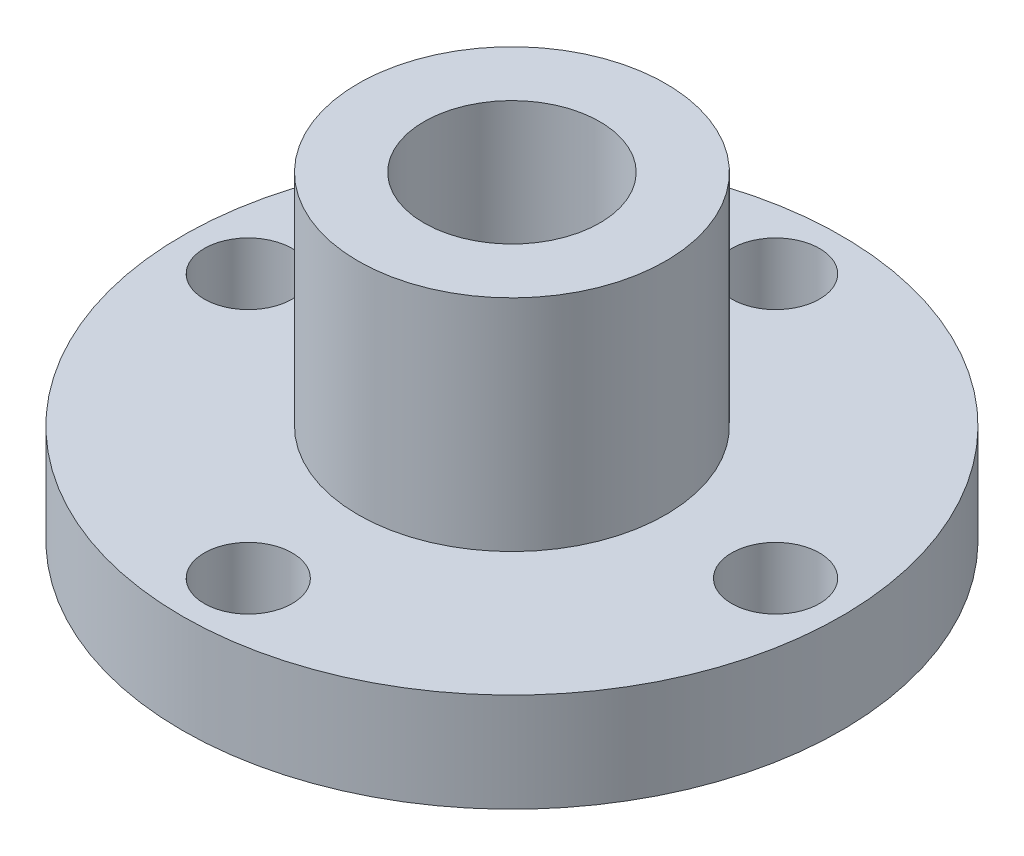
ISO-10303-21;
HEADER;
FILE_DESCRIPTION(('STEP AP214'),'2;1');
FILE_NAME('part.step','',(''),(''),'','','');
FILE_SCHEMA(('AUTOMOTIVE_DESIGN { 1 0 10303 214 1 1 1 1 }'));
ENDSEC;
DATA;
#1=APPLICATION_CONTEXT('core data for automotive mechanical design processes');
#2=APPLICATION_PROTOCOL_DEFINITION('international standard','automotive_design',2000,#1);
#3=PRODUCT_CONTEXT('',#1,'mechanical');
#4=PRODUCT('Part','Part','',(#3));
#5=PRODUCT_RELATED_PRODUCT_CATEGORY('part','',(#4));
#6=PRODUCT_DEFINITION_FORMATION('','',#4);
#7=PRODUCT_DEFINITION_CONTEXT('part definition',#1,'design');
#8=PRODUCT_DEFINITION('design','',#6,#7);
#9=PRODUCT_DEFINITION_SHAPE('','',#8);
#10=(LENGTH_UNIT() NAMED_UNIT(*) SI_UNIT(.MILLI.,.METRE.));
#11=(NAMED_UNIT(*) PLANE_ANGLE_UNIT() SI_UNIT($,.RADIAN.));
#12=(NAMED_UNIT(*) SI_UNIT($,.STERADIAN.) SOLID_ANGLE_UNIT());
#13=UNCERTAINTY_MEASURE_WITH_UNIT(LENGTH_MEASURE(1.E-05),#10,'distance_accuracy_value','');
#14=(GEOMETRIC_REPRESENTATION_CONTEXT(3) GLOBAL_UNCERTAINTY_ASSIGNED_CONTEXT((#13)) GLOBAL_UNIT_ASSIGNED_CONTEXT((#10,
#11,#12)) REPRESENTATION_CONTEXT('',''));
#15=CARTESIAN_POINT('',(0.,0.,0.));
#16=DIRECTION('',(0.,0.,1.));
#17=DIRECTION('',(1.,0.,0.));
#18=AXIS2_PLACEMENT_3D('',#15,#16,#17);
#19=CARTESIAN_POINT('',(0.,4.49999999999999,0.));
#20=DIRECTION('',(0.,-1.,0.));
#21=DIRECTION('',(0.,0.,-1.));
#22=AXIS2_PLACEMENT_3D('',#19,#20,#21);
#23=CYLINDRICAL_SURFACE('',#22,15.);
#24=CARTESIAN_POINT('',(0.,4.49999999999999,0.));
#25=DIRECTION('',(0.,1.,0.));
#26=DIRECTION('',(0.,0.,1.));
#27=AXIS2_PLACEMENT_3D('',#24,#25,#26);
#28=CIRCLE('',#27,15.);
#29=CARTESIAN_POINT('',(0.,4.49999999999999,15.));
#30=VERTEX_POINT('',#29);
#31=EDGE_CURVE('E41',#30,#30,#28,.T.);
#32=ORIENTED_EDGE('',*,*,#31,.F.);
#33=EDGE_LOOP('',(#32));
#34=FACE_BOUND('',#33,.T.);
#35=CARTESIAN_POINT('',(0.,0.,0.));
#36=DIRECTION('',(0.,1.,0.));
#37=DIRECTION('',(0.,0.,1.));
#38=AXIS2_PLACEMENT_3D('',#35,#36,#37);
#39=CIRCLE('',#38,15.);
#40=CARTESIAN_POINT('',(0.,0.,15.));
#41=VERTEX_POINT('',#40);
#42=EDGE_CURVE('E46',#41,#41,#39,.T.);
#43=ORIENTED_EDGE('',*,*,#42,.T.);
#44=EDGE_LOOP('',(#43));
#45=FACE_BOUND('',#44,.T.);
#46=ADVANCED_FACE('F34',(#34,#45),#23,.T.);
#47=CARTESIAN_POINT('',(0.,4.49999999999999,0.));
#48=DIRECTION('',(0.,1.,0.));
#49=DIRECTION('',(0.,0.,1.));
#50=AXIS2_PLACEMENT_3D('',#47,#48,#49);
#51=PLANE('',#50);
#52=CARTESIAN_POINT('',(0.,4.49999999999999,-12.));
#53=DIRECTION('',(0.,1.,0.));
#54=DIRECTION('',(0.,0.,1.));
#55=AXIS2_PLACEMENT_3D('',#52,#53,#54);
#56=CIRCLE('',#55,2.);
#57=CARTESIAN_POINT('',(0.,4.49999999999999,-10.));
#58=VERTEX_POINT('',#57);
#59=EDGE_CURVE('E58',#58,#58,#56,.T.);
#60=ORIENTED_EDGE('',*,*,#59,.F.);
#61=EDGE_LOOP('',(#60));
#62=FACE_BOUND('',#61,.T.);
#63=CARTESIAN_POINT('',(12.0000000000004,4.49999999999999,-4.24304974237467E-13));
#64=DIRECTION('',(0.,1.,0.));
#65=DIRECTION('',(0.,0.,1.));
#66=AXIS2_PLACEMENT_3D('',#63,#64,#65);
#67=CIRCLE('',#66,2.);
#68=CARTESIAN_POINT('',(12.0000000000004,4.49999999999999,1.99999999999958));
#69=VERTEX_POINT('',#68);
#70=EDGE_CURVE('E81',#69,#69,#67,.T.);
#71=ORIENTED_EDGE('',*,*,#70,.F.);
#72=EDGE_LOOP('',(#71));
#73=FACE_BOUND('',#72,.T.);
#74=CARTESIAN_POINT('',(8.48609948474934E-13,4.49999999999999,12.));
#75=DIRECTION('',(0.,1.,0.));
#76=DIRECTION('',(0.,0.,1.));
#77=AXIS2_PLACEMENT_3D('',#74,#75,#76);
#78=CIRCLE('',#77,2.);
#79=CARTESIAN_POINT('',(8.48609948474934E-13,4.49999999999999,14.));
#80=VERTEX_POINT('',#79);
#81=EDGE_CURVE('E78',#80,#80,#78,.T.);
#82=ORIENTED_EDGE('',*,*,#81,.F.);
#83=EDGE_LOOP('',(#82));
#84=FACE_BOUND('',#83,.T.);
#85=CARTESIAN_POINT('',(-11.9999999999996,4.49999999999999,4.25774550396444E-13));
#86=DIRECTION('',(0.,1.,0.));
#87=DIRECTION('',(0.,0.,1.));
#88=AXIS2_PLACEMENT_3D('',#85,#86,#87);
#89=CIRCLE('',#88,2.);
#90=CARTESIAN_POINT('',(-11.9999999999996,4.49999999999999,2.00000000000043));
#91=VERTEX_POINT('',#90);
#92=EDGE_CURVE('E75',#91,#91,#89,.T.);
#93=ORIENTED_EDGE('',*,*,#92,.F.);
#94=EDGE_LOOP('',(#93));
#95=FACE_BOUND('',#94,.T.);
#96=CARTESIAN_POINT('',(0.,4.49999999999999,0.));
#97=DIRECTION('',(0.,1.,0.));
#98=DIRECTION('',(0.,0.,1.));
#99=AXIS2_PLACEMENT_3D('',#96,#97,#98);
#100=CIRCLE('',#99,7.);
#101=CARTESIAN_POINT('',(0.,4.49999999999999,7.));
#102=VERTEX_POINT('',#101);
#103=EDGE_CURVE('E10',#102,#102,#100,.T.);
#104=ORIENTED_EDGE('',*,*,#103,.F.);
#105=EDGE_LOOP('',(#104));
#106=FACE_BOUND('',#105,.T.);
#107=ORIENTED_EDGE('',*,*,#31,.T.);
#108=EDGE_LOOP('',(#107));
#109=FACE_BOUND('',#108,.T.);
#110=ADVANCED_FACE('F90',(#62,#73,#84,#95,#106,#109),#51,.T.);
#111=CARTESIAN_POINT('',(0.,0.,0.));
#112=DIRECTION('',(0.,1.,0.));
#113=DIRECTION('',(0.,0.,1.));
#114=AXIS2_PLACEMENT_3D('',#111,#112,#113);
#115=PLANE('',#114);
#116=CARTESIAN_POINT('',(0.,0.,-12.));
#117=DIRECTION('',(0.,1.,0.));
#118=DIRECTION('',(0.,0.,1.));
#119=AXIS2_PLACEMENT_3D('',#116,#117,#118);
#120=CIRCLE('',#119,2.);
#121=CARTESIAN_POINT('',(0.,0.,-10.));
#122=VERTEX_POINT('',#121);
#123=EDGE_CURVE('E37',#122,#122,#120,.T.);
#124=ORIENTED_EDGE('',*,*,#123,.T.);
#125=EDGE_LOOP('',(#124));
#126=FACE_BOUND('',#125,.T.);
#127=CARTESIAN_POINT('',(12.0000000000004,0.,-4.24304974237467E-13));
#128=DIRECTION('',(0.,1.,0.));
#129=DIRECTION('',(0.,0.,1.));
#130=AXIS2_PLACEMENT_3D('',#127,#128,#129);
#131=CIRCLE('',#130,2.);
#132=CARTESIAN_POINT('',(12.0000000000004,0.,1.99999999999958));
#133=VERTEX_POINT('',#132);
#134=EDGE_CURVE('E60',#133,#133,#131,.T.);
#135=ORIENTED_EDGE('',*,*,#134,.T.);
#136=EDGE_LOOP('',(#135));
#137=FACE_BOUND('',#136,.T.);
#138=CARTESIAN_POINT('',(8.48609948474934E-13,0.,12.));
#139=DIRECTION('',(0.,1.,0.));
#140=DIRECTION('',(0.,0.,1.));
#141=AXIS2_PLACEMENT_3D('',#138,#139,#140);
#142=CIRCLE('',#141,2.);
#143=CARTESIAN_POINT('',(8.48609948474934E-13,0.,14.));
#144=VERTEX_POINT('',#143);
#145=EDGE_CURVE('E57',#144,#144,#142,.T.);
#146=ORIENTED_EDGE('',*,*,#145,.T.);
#147=EDGE_LOOP('',(#146));
#148=FACE_BOUND('',#147,.T.);
#149=CARTESIAN_POINT('',(-11.9999999999996,0.,4.25774550396444E-13));
#150=DIRECTION('',(0.,1.,0.));
#151=DIRECTION('',(0.,0.,1.));
#152=AXIS2_PLACEMENT_3D('',#149,#150,#151);
#153=CIRCLE('',#152,2.);
#154=CARTESIAN_POINT('',(-11.9999999999996,0.,2.00000000000043));
#155=VERTEX_POINT('',#154);
#156=EDGE_CURVE('E54',#155,#155,#153,.T.);
#157=ORIENTED_EDGE('',*,*,#156,.T.);
#158=EDGE_LOOP('',(#157));
#159=FACE_BOUND('',#158,.T.);
#160=CARTESIAN_POINT('',(0.,0.,0.));
#161=DIRECTION('',(0.,1.,0.));
#162=DIRECTION('',(0.,0.,1.));
#163=AXIS2_PLACEMENT_3D('',#160,#161,#162);
#164=CIRCLE('',#163,4.);
#165=CARTESIAN_POINT('',(0.,0.,4.));
#166=VERTEX_POINT('',#165);
#167=EDGE_CURVE('E69',#166,#166,#164,.T.);
#168=ORIENTED_EDGE('',*,*,#167,.T.);
#169=EDGE_LOOP('',(#168));
#170=FACE_BOUND('',#169,.T.);
#171=ORIENTED_EDGE('',*,*,#42,.F.);
#172=EDGE_LOOP('',(#171));
#173=FACE_BOUND('',#172,.T.);
#174=ADVANCED_FACE('F93',(#126,#137,#148,#159,#170,#173),#115,.F.);
#175=CARTESIAN_POINT('',(0.,14.5,0.));
#176=DIRECTION('',(0.,-1.,0.));
#177=DIRECTION('',(0.,0.,-1.));
#178=AXIS2_PLACEMENT_3D('',#175,#176,#177);
#179=CYLINDRICAL_SURFACE('',#178,7.);
#180=CARTESIAN_POINT('',(0.,14.5,0.));
#181=DIRECTION('',(0.,1.,0.));
#182=DIRECTION('',(0.,0.,1.));
#183=AXIS2_PLACEMENT_3D('',#180,#181,#182);
#184=CIRCLE('',#183,7.);
#185=CARTESIAN_POINT('',(0.,14.5,7.));
#186=VERTEX_POINT('',#185);
#187=EDGE_CURVE('E49',#186,#186,#184,.T.);
#188=ORIENTED_EDGE('',*,*,#187,.F.);
#189=EDGE_LOOP('',(#188));
#190=FACE_BOUND('',#189,.T.);
#191=ORIENTED_EDGE('',*,*,#103,.T.);
#192=EDGE_LOOP('',(#191));
#193=FACE_BOUND('',#192,.T.);
#194=ADVANCED_FACE('F109',(#190,#193),#179,.T.);
#195=CARTESIAN_POINT('',(0.,14.5,0.));
#196=DIRECTION('',(0.,1.,0.));
#197=DIRECTION('',(0.,0.,1.));
#198=AXIS2_PLACEMENT_3D('',#195,#196,#197);
#199=PLANE('',#198);
#200=CARTESIAN_POINT('',(0.,14.5,0.));
#201=DIRECTION('',(0.,1.,0.));
#202=DIRECTION('',(0.,0.,1.));
#203=AXIS2_PLACEMENT_3D('',#200,#201,#202);
#204=CIRCLE('',#203,4.);
#205=CARTESIAN_POINT('',(0.,14.5,4.));
#206=VERTEX_POINT('',#205);
#207=EDGE_CURVE('E65',#206,#206,#204,.T.);
#208=ORIENTED_EDGE('',*,*,#207,.F.);
#209=EDGE_LOOP('',(#208));
#210=FACE_BOUND('',#209,.T.);
#211=ORIENTED_EDGE('',*,*,#187,.T.);
#212=EDGE_LOOP('',(#211));
#213=FACE_BOUND('',#212,.T.);
#214=ADVANCED_FACE('F113',(#210,#213),#199,.T.);
#215=CARTESIAN_POINT('',(0.,-0.500000000000006,0.));
#216=DIRECTION('',(0.,1.,0.));
#217=DIRECTION('',(0.,0.,1.));
#218=AXIS2_PLACEMENT_3D('',#215,#216,#217);
#219=CYLINDRICAL_SURFACE('',#218,4.);
#220=ORIENTED_EDGE('',*,*,#207,.T.);
#221=EDGE_LOOP('',(#220));
#222=FACE_BOUND('',#221,.T.);
#223=ORIENTED_EDGE('',*,*,#167,.F.);
#224=EDGE_LOOP('',(#223));
#225=FACE_BOUND('',#224,.T.);
#226=ADVANCED_FACE('F119',(#222,#225),#219,.F.);
#227=CARTESIAN_POINT('',(-11.9999999999996,-5.50000000000001,4.25774550396444E-13));
#228=DIRECTION('',(0.,1.,0.));
#229=DIRECTION('',(0.,0.,1.));
#230=AXIS2_PLACEMENT_3D('',#227,#228,#229);
#231=CYLINDRICAL_SURFACE('',#230,2.);
#232=ORIENTED_EDGE('',*,*,#92,.T.);
#233=EDGE_LOOP('',(#232));
#234=FACE_BOUND('',#233,.T.);
#235=ORIENTED_EDGE('',*,*,#156,.F.);
#236=EDGE_LOOP('',(#235));
#237=FACE_BOUND('',#236,.T.);
#238=ADVANCED_FACE('F123',(#234,#237),#231,.F.);
#239=CARTESIAN_POINT('',(8.48609948474934E-13,-5.50000000000001,12.));
#240=DIRECTION('',(0.,1.,0.));
#241=DIRECTION('',(0.,0.,1.));
#242=AXIS2_PLACEMENT_3D('',#239,#240,#241);
#243=CYLINDRICAL_SURFACE('',#242,2.);
#244=ORIENTED_EDGE('',*,*,#81,.T.);
#245=EDGE_LOOP('',(#244));
#246=FACE_BOUND('',#245,.T.);
#247=ORIENTED_EDGE('',*,*,#145,.F.);
#248=EDGE_LOOP('',(#247));
#249=FACE_BOUND('',#248,.T.);
#250=ADVANCED_FACE('F126',(#246,#249),#243,.F.);
#251=CARTESIAN_POINT('',(12.0000000000004,-5.50000000000001,-4.24304974237467E-13));
#252=DIRECTION('',(0.,1.,0.));
#253=DIRECTION('',(0.,0.,1.));
#254=AXIS2_PLACEMENT_3D('',#251,#252,#253);
#255=CYLINDRICAL_SURFACE('',#254,2.);
#256=ORIENTED_EDGE('',*,*,#70,.T.);
#257=EDGE_LOOP('',(#256));
#258=FACE_BOUND('',#257,.T.);
#259=ORIENTED_EDGE('',*,*,#134,.F.);
#260=EDGE_LOOP('',(#259));
#261=FACE_BOUND('',#260,.T.);
#262=ADVANCED_FACE('F130',(#258,#261),#255,.F.);
#263=CARTESIAN_POINT('',(0.,-5.50000000000001,-12.));
#264=DIRECTION('',(0.,1.,0.));
#265=DIRECTION('',(0.,0.,1.));
#266=AXIS2_PLACEMENT_3D('',#263,#264,#265);
#267=CYLINDRICAL_SURFACE('',#266,2.);
#268=ORIENTED_EDGE('',*,*,#59,.T.);
#269=EDGE_LOOP('',(#268));
#270=FACE_BOUND('',#269,.T.);
#271=ORIENTED_EDGE('',*,*,#123,.F.);
#272=EDGE_LOOP('',(#271));
#273=FACE_BOUND('',#272,.T.);
#274=ADVANCED_FACE('F87',(#270,#273),#267,.F.);
#275=CLOSED_SHELL('',(#46,#110,#174,#194,#214,#226,#238,#250,#262,#274));
#276=MANIFOLD_SOLID_BREP('B2',#275);
#277=ADVANCED_BREP_SHAPE_REPRESENTATION('',(#18,#276),#14);
#278=SHAPE_DEFINITION_REPRESENTATION(#9,#277);
ENDSEC;
END-ISO-10303-21;
